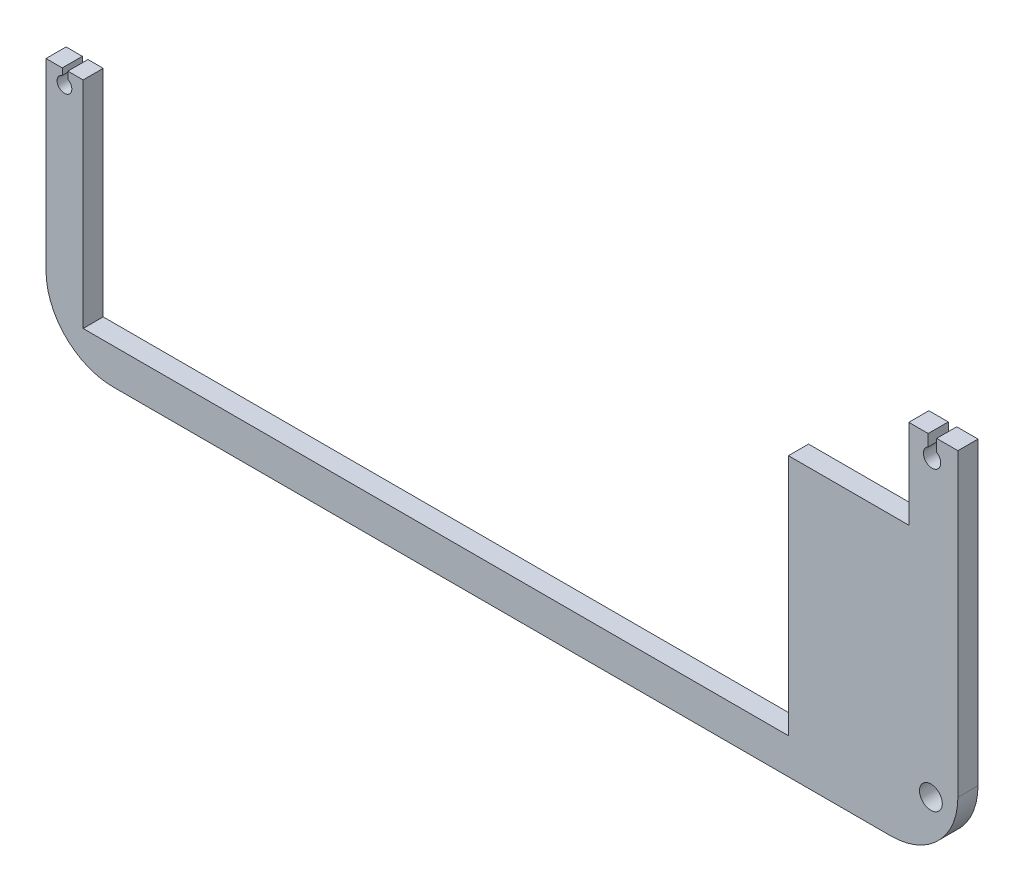
ISO-10303-21;
HEADER;
FILE_DESCRIPTION(('STEP AP214'),'2;1');
FILE_NAME('part.step','',(''),(''),'','','');
FILE_SCHEMA(('AUTOMOTIVE_DESIGN { 1 0 10303 214 1 1 1 1 }'));
ENDSEC;
DATA;
#1=APPLICATION_CONTEXT('core data for automotive mechanical design processes');
#2=APPLICATION_PROTOCOL_DEFINITION('international standard','automotive_design',2000,#1);
#3=PRODUCT_CONTEXT('',#1,'mechanical');
#4=PRODUCT('Part','Part','',(#3));
#5=PRODUCT_RELATED_PRODUCT_CATEGORY('part','',(#4));
#6=PRODUCT_DEFINITION_FORMATION('','',#4);
#7=PRODUCT_DEFINITION_CONTEXT('part definition',#1,'design');
#8=PRODUCT_DEFINITION('design','',#6,#7);
#9=PRODUCT_DEFINITION_SHAPE('','',#8);
#10=(LENGTH_UNIT() NAMED_UNIT(*) SI_UNIT(.MILLI.,.METRE.));
#11=(NAMED_UNIT(*) PLANE_ANGLE_UNIT() SI_UNIT($,.RADIAN.));
#12=(NAMED_UNIT(*) SI_UNIT($,.STERADIAN.) SOLID_ANGLE_UNIT());
#13=UNCERTAINTY_MEASURE_WITH_UNIT(LENGTH_MEASURE(1.E-05),#10,'distance_accuracy_value','');
#14=(GEOMETRIC_REPRESENTATION_CONTEXT(3) GLOBAL_UNCERTAINTY_ASSIGNED_CONTEXT((#13)) GLOBAL_UNIT_ASSIGNED_CONTEXT((#10,
#11,#12)) REPRESENTATION_CONTEXT('',''));
#15=CARTESIAN_POINT('',(0.,0.,0.));
#16=DIRECTION('',(0.,0.,1.));
#17=DIRECTION('',(1.,0.,0.));
#18=AXIS2_PLACEMENT_3D('',#15,#16,#17);
#19=CARTESIAN_POINT('',(-93.5366002876996,83.7988417423297,3.));
#20=DIRECTION('',(0.,0.,1.));
#21=DIRECTION('',(1.,0.,0.));
#22=AXIS2_PLACEMENT_3D('',#19,#20,#21);
#23=PLANE('',#22);
#24=DIRECTION('',(1.,0.,0.));
#25=VECTOR('',#24,1.);
#26=CARTESIAN_POINT('',(36.4199959893713,128.591552724159,3.));
#27=LINE('',#26,#25);
#28=CARTESIAN_POINT('',(29.3570180219026,128.591552724159,3.));
#29=VERTEX_POINT('',#28);
#30=CARTESIAN_POINT('',(32.5266585604708,128.591552724159,3.));
#31=VERTEX_POINT('',#30);
#32=EDGE_CURVE('E210',#29,#31,#27,.T.);
#33=ORIENTED_EDGE('',*,*,#32,.F.);
#34=DIRECTION('',(0.,1.,0.));
#35=VECTOR('',#34,1.);
#36=CARTESIAN_POINT('',(29.3570180219026,128.591552724159,3.));
#37=LINE('',#36,#35);
#38=CARTESIAN_POINT('',(29.3570180219026,126.795559320055,3.));
#39=VERTEX_POINT('',#38);
#40=EDGE_CURVE('E207',#39,#29,#37,.T.);
#41=ORIENTED_EDGE('',*,*,#40,.F.);
#42=CARTESIAN_POINT('',(28.6721951581703,125.696250987203,3.));
#43=DIRECTION('',(0.,0.,1.));
#44=DIRECTION('',(1.,0.,0.));
#45=AXIS2_PLACEMENT_3D('',#42,#43,#44);
#46=CIRCLE('',#45,1.29516839266913);
#47=CARTESIAN_POINT('',(28.0964021702591,126.856390461767,3.));
#48=VERTEX_POINT('',#47);
#49=EDGE_CURVE('E204',#48,#39,#46,.T.);
#50=ORIENTED_EDGE('',*,*,#49,.F.);
#51=DIRECTION('',(0.,-1.,0.));
#52=VECTOR('',#51,1.);
#53=CARTESIAN_POINT('',(28.0964021702591,126.856390461767,3.));
#54=LINE('',#53,#52);
#55=CARTESIAN_POINT('',(28.0964021702591,128.591552724159,3.));
#56=VERTEX_POINT('',#55);
#57=EDGE_CURVE('E201',#56,#48,#54,.T.);
#58=ORIENTED_EDGE('',*,*,#57,.F.);
#59=DIRECTION('',(1.,0.,0.));
#60=VECTOR('',#59,1.);
#61=CARTESIAN_POINT('',(28.0964021702591,128.591552724159,3.));
#62=LINE('',#61,#60);
#63=CARTESIAN_POINT('',(25.2004644446023,128.591552724159,3.));
#64=VERTEX_POINT('',#63);
#65=EDGE_CURVE('E196',#64,#56,#62,.T.);
#66=ORIENTED_EDGE('',*,*,#65,.F.);
#67=DIRECTION('',(0.,1.,0.));
#68=VECTOR('',#67,1.);
#69=CARTESIAN_POINT('',(25.2004644446023,115.29884174233,3.));
#70=LINE('',#69,#68);
#71=CARTESIAN_POINT('',(25.2004644446023,115.29884174233,3.));
#72=VERTEX_POINT('',#71);
#73=EDGE_CURVE('E254',#72,#64,#70,.T.);
#74=ORIENTED_EDGE('',*,*,#73,.F.);
#75=DIRECTION('',(1.,0.,0.));
#76=VECTOR('',#75,1.);
#77=CARTESIAN_POINT('',(7.24125127890715,115.29884174233,3.));
#78=LINE('',#77,#76);
#79=CARTESIAN_POINT('',(7.24125127890715,115.29884174233,3.));
#80=VERTEX_POINT('',#79);
#81=EDGE_CURVE('E252',#80,#72,#78,.T.);
#82=ORIENTED_EDGE('',*,*,#81,.F.);
#83=DIRECTION('',(0.,1.,0.));
#84=VECTOR('',#83,1.);
#85=CARTESIAN_POINT('',(7.24125127890715,79.1137548031266,3.));
#86=LINE('',#85,#84);
#87=CARTESIAN_POINT('',(7.24125127890715,79.1137548031266,3.));
#88=VERTEX_POINT('',#87);
#89=EDGE_CURVE('E249',#88,#80,#86,.T.);
#90=ORIENTED_EDGE('',*,*,#89,.F.);
#91=DIRECTION('',(1.,0.,0.));
#92=VECTOR('',#91,1.);
#93=CARTESIAN_POINT('',(-98.,79.1137548031266,3.));
#94=LINE('',#93,#92);
#95=CARTESIAN_POINT('',(-98.,79.1137548031266,3.));
#96=VERTEX_POINT('',#95);
#97=EDGE_CURVE('E247',#96,#88,#94,.T.);
#98=ORIENTED_EDGE('',*,*,#97,.F.);
#99=DIRECTION('',(0.,-1.,0.));
#100=VECTOR('',#99,1.);
#101=CARTESIAN_POINT('',(-98.,139.29884174233,3.));
#102=LINE('',#101,#100);
#103=CARTESIAN_POINT('',(-98.,111.232980273144,3.));
#104=VERTEX_POINT('',#103);
#105=EDGE_CURVE('E257',#104,#96,#102,.T.);
#106=ORIENTED_EDGE('',*,*,#105,.F.);
#107=DIRECTION('',(1.,0.,0.));
#108=VECTOR('',#107,1.);
#109=CARTESIAN_POINT('',(-98.,111.232980273144,3.));
#110=LINE('',#109,#108);
#111=CARTESIAN_POINT('',(-100.276015926956,111.232980273144,3.));
#112=VERTEX_POINT('',#111);
#113=EDGE_CURVE('E55',#112,#104,#110,.T.);
#114=ORIENTED_EDGE('',*,*,#113,.F.);
#115=DIRECTION('',(0.,1.,0.));
#116=VECTOR('',#115,1.);
#117=CARTESIAN_POINT('',(-100.276015926956,110.18127949506,3.));
#118=LINE('',#117,#116);
#119=CARTESIAN_POINT('',(-100.276015926956,110.18127949506,3.));
#120=VERTEX_POINT('',#119);
#121=EDGE_CURVE('E175',#120,#112,#118,.T.);
#122=ORIENTED_EDGE('',*,*,#121,.F.);
#123=CARTESIAN_POINT('',(-100.78551890269,109.206298272728,3.));
#124=DIRECTION('',(0.,0.,1.));
#125=DIRECTION('',(1.,0.,0.));
#126=AXIS2_PLACEMENT_3D('',#123,#124,#125);
#127=CIRCLE('',#126,1.10008257243818);
#128=CARTESIAN_POINT('',(-101.110575193587,110.257259772466,3.));
#129=VERTEX_POINT('',#128);
#130=EDGE_CURVE('E184',#129,#120,#127,.T.);
#131=ORIENTED_EDGE('',*,*,#130,.F.);
#132=DIRECTION('',(0.,-1.,0.));
#133=VECTOR('',#132,1.);
#134=CARTESIAN_POINT('',(-101.110575193587,110.257259772466,3.));
#135=LINE('',#134,#133);
#136=CARTESIAN_POINT('',(-101.110575193587,111.232980273144,3.));
#137=VERTEX_POINT('',#136);
#138=EDGE_CURVE('E181',#137,#129,#135,.T.);
#139=ORIENTED_EDGE('',*,*,#138,.F.);
#140=DIRECTION('',(1.,0.,0.));
#141=VECTOR('',#140,1.);
#142=CARTESIAN_POINT('',(-101.110575193587,111.232980273144,3.));
#143=LINE('',#142,#141);
#144=CARTESIAN_POINT('',(-103.5366002877,111.232980273144,3.));
#145=VERTEX_POINT('',#144);
#146=EDGE_CURVE('E212',#145,#137,#143,.T.);
#147=ORIENTED_EDGE('',*,*,#146,.F.);
#148=DIRECTION('',(0.,-1.,0.));
#149=VECTOR('',#148,1.);
#150=CARTESIAN_POINT('',(-103.5366002877,133.79884174233,3.));
#151=LINE('',#150,#149);
#152=CARTESIAN_POINT('',(-103.5366002877,83.7988417423297,3.));
#153=VERTEX_POINT('',#152);
#154=EDGE_CURVE('E293',#145,#153,#151,.T.);
#155=ORIENTED_EDGE('',*,*,#154,.T.);
#156=CARTESIAN_POINT('',(-93.5366002876996,83.7988417423297,3.));
#157=DIRECTION('',(0.,0.,1.));
#158=DIRECTION('',(1.,0.,0.));
#159=AXIS2_PLACEMENT_3D('',#156,#157,#158);
#160=CIRCLE('',#159,10.);
#161=CARTESIAN_POINT('',(-93.5366002876996,73.7988417423297,3.));
#162=VERTEX_POINT('',#161);
#163=EDGE_CURVE('E282',#153,#162,#160,.T.);
#164=ORIENTED_EDGE('',*,*,#163,.T.);
#165=DIRECTION('',(1.,0.,0.));
#166=VECTOR('',#165,1.);
#167=CARTESIAN_POINT('',(-93.5366002876996,73.7988417423297,3.));
#168=LINE('',#167,#166);
#169=CARTESIAN_POINT('',(22.5266585604708,73.7988417423297,3.));
#170=VERTEX_POINT('',#169);
#171=EDGE_CURVE('E285',#162,#170,#168,.T.);
#172=ORIENTED_EDGE('',*,*,#171,.T.);
#173=CARTESIAN_POINT('',(22.5266585604708,83.7988417423297,3.));
#174=DIRECTION('',(0.,0.,1.));
#175=DIRECTION('',(1.,0.,0.));
#176=AXIS2_PLACEMENT_3D('',#173,#174,#175);
#177=CIRCLE('',#176,10.);
#178=CARTESIAN_POINT('',(32.5266585604708,83.7988417423297,3.));
#179=VERTEX_POINT('',#178);
#180=EDGE_CURVE('E288',#170,#179,#177,.T.);
#181=ORIENTED_EDGE('',*,*,#180,.T.);
#182=DIRECTION('',(0.,1.,0.));
#183=VECTOR('',#182,1.);
#184=CARTESIAN_POINT('',(32.5266585604708,83.7988417423297,3.));
#185=LINE('',#184,#183);
#186=EDGE_CURVE('E290',#179,#31,#185,.T.);
#187=ORIENTED_EDGE('',*,*,#186,.T.);
#188=EDGE_LOOP('',(#33,#41,#50,#58,#66,#74,#82,#90,#98,#106,#114,#122,#131,#139,#147,#155,#164,
#172,#181,#187));
#189=FACE_BOUND('',#188,.T.);
#190=CARTESIAN_POINT('',(28.4975365255553,81.7988417423297,3.));
#191=DIRECTION('',(0.,0.,-1.));
#192=DIRECTION('',(-1.,0.,0.));
#193=AXIS2_PLACEMENT_3D('',#190,#191,#192);
#194=CIRCLE('',#193,1.7);
#195=CARTESIAN_POINT('',(26.7975365255553,81.7988417423297,3.));
#196=VERTEX_POINT('',#195);
#197=EDGE_CURVE('E243',#196,#196,#194,.T.);
#198=ORIENTED_EDGE('',*,*,#197,.T.);
#199=EDGE_LOOP('',(#198));
#200=FACE_BOUND('',#199,.T.);
#201=ADVANCED_FACE('F32',(#189,#200),#23,.T.);
#202=CARTESIAN_POINT('',(-93.5366002876996,83.7988417423297,0.));
#203=DIRECTION('',(0.,0.,1.));
#204=DIRECTION('',(1.,0.,0.));
#205=AXIS2_PLACEMENT_3D('',#202,#203,#204);
#206=PLANE('',#205);
#207=CARTESIAN_POINT('',(28.4975365255553,81.7988417423297,0.));
#208=DIRECTION('',(0.,0.,-1.));
#209=DIRECTION('',(-1.,0.,0.));
#210=AXIS2_PLACEMENT_3D('',#207,#208,#209);
#211=CIRCLE('',#210,1.69999999999999);
#212=CARTESIAN_POINT('',(26.7975365255553,81.7988417423297,0.));
#213=VERTEX_POINT('',#212);
#214=EDGE_CURVE('E240',#213,#213,#211,.T.);
#215=ORIENTED_EDGE('',*,*,#214,.F.);
#216=EDGE_LOOP('',(#215));
#217=FACE_BOUND('',#216,.T.);
#218=DIRECTION('',(0.,1.,0.));
#219=VECTOR('',#218,1.);
#220=CARTESIAN_POINT('',(29.3570180219026,83.7988417423297,0.));
#221=LINE('',#220,#219);
#222=CARTESIAN_POINT('',(29.3570180219026,126.795559320055,0.));
#223=VERTEX_POINT('',#222);
#224=CARTESIAN_POINT('',(29.3570180219026,128.591552724159,0.));
#225=VERTEX_POINT('',#224);
#226=EDGE_CURVE('E11',#223,#225,#221,.T.);
#227=ORIENTED_EDGE('',*,*,#226,.T.);
#228=DIRECTION('',(1.,0.,0.));
#229=VECTOR('',#228,1.);
#230=CARTESIAN_POINT('',(-93.5366002876996,128.591552724159,0.));
#231=LINE('',#230,#229);
#232=CARTESIAN_POINT('',(32.5266585604708,128.591552724159,0.));
#233=VERTEX_POINT('',#232);
#234=EDGE_CURVE('E237',#225,#233,#231,.T.);
#235=ORIENTED_EDGE('',*,*,#234,.T.);
#236=DIRECTION('',(0.,1.,0.));
#237=VECTOR('',#236,1.);
#238=CARTESIAN_POINT('',(32.5266585604708,83.7988417423297,0.));
#239=LINE('',#238,#237);
#240=CARTESIAN_POINT('',(32.5266585604708,83.7988417423297,0.));
#241=VERTEX_POINT('',#240);
#242=EDGE_CURVE('E302',#241,#233,#239,.T.);
#243=ORIENTED_EDGE('',*,*,#242,.F.);
#244=CARTESIAN_POINT('',(22.5266585604708,83.7988417423297,0.));
#245=DIRECTION('',(0.,0.,1.));
#246=DIRECTION('',(1.,0.,0.));
#247=AXIS2_PLACEMENT_3D('',#244,#245,#246);
#248=CIRCLE('',#247,10.);
#249=CARTESIAN_POINT('',(22.5266585604708,73.7988417423297,0.));
#250=VERTEX_POINT('',#249);
#251=EDGE_CURVE('E300',#250,#241,#248,.T.);
#252=ORIENTED_EDGE('',*,*,#251,.F.);
#253=DIRECTION('',(1.,0.,0.));
#254=VECTOR('',#253,1.);
#255=CARTESIAN_POINT('',(-93.5366002876996,73.7988417423297,0.));
#256=LINE('',#255,#254);
#257=CARTESIAN_POINT('',(-93.5366002876996,73.7988417423297,0.));
#258=VERTEX_POINT('',#257);
#259=EDGE_CURVE('E298',#258,#250,#256,.T.);
#260=ORIENTED_EDGE('',*,*,#259,.F.);
#261=CARTESIAN_POINT('',(-93.5366002876996,83.7988417423297,0.));
#262=DIRECTION('',(0.,0.,1.));
#263=DIRECTION('',(1.,0.,0.));
#264=AXIS2_PLACEMENT_3D('',#261,#262,#263);
#265=CIRCLE('',#264,10.);
#266=CARTESIAN_POINT('',(-103.5366002877,83.7988417423297,0.));
#267=VERTEX_POINT('',#266);
#268=EDGE_CURVE('E281',#267,#258,#265,.T.);
#269=ORIENTED_EDGE('',*,*,#268,.F.);
#270=DIRECTION('',(0.,-1.,0.));
#271=VECTOR('',#270,1.);
#272=CARTESIAN_POINT('',(-103.5366002877,133.79884174233,0.));
#273=LINE('',#272,#271);
#274=CARTESIAN_POINT('',(-103.5366002877,111.232980273144,0.));
#275=VERTEX_POINT('',#274);
#276=EDGE_CURVE('E286',#275,#267,#273,.T.);
#277=ORIENTED_EDGE('',*,*,#276,.F.);
#278=DIRECTION('',(1.,0.,0.));
#279=VECTOR('',#278,1.);
#280=CARTESIAN_POINT('',(-93.5366002876996,111.232980273144,0.));
#281=LINE('',#280,#279);
#282=CARTESIAN_POINT('',(-101.110575193587,111.232980273144,0.));
#283=VERTEX_POINT('',#282);
#284=EDGE_CURVE('E234',#275,#283,#281,.T.);
#285=ORIENTED_EDGE('',*,*,#284,.T.);
#286=DIRECTION('',(0.,-1.,0.));
#287=VECTOR('',#286,1.);
#288=CARTESIAN_POINT('',(-101.110575193587,83.7988417423297,0.));
#289=LINE('',#288,#287);
#290=CARTESIAN_POINT('',(-101.110575193587,110.257259772466,0.));
#291=VERTEX_POINT('',#290);
#292=EDGE_CURVE('E328',#283,#291,#289,.T.);
#293=ORIENTED_EDGE('',*,*,#292,.T.);
#294=CARTESIAN_POINT('',(-100.78551890269,109.206298272728,0.));
#295=DIRECTION('',(0.,0.,1.));
#296=DIRECTION('',(1.,0.,0.));
#297=AXIS2_PLACEMENT_3D('',#294,#295,#296);
#298=CIRCLE('',#297,1.10008257243818);
#299=CARTESIAN_POINT('',(-100.276015926956,110.18127949506,0.));
#300=VERTEX_POINT('',#299);
#301=EDGE_CURVE('E326',#291,#300,#298,.T.);
#302=ORIENTED_EDGE('',*,*,#301,.T.);
#303=DIRECTION('',(0.,1.,0.));
#304=VECTOR('',#303,1.);
#305=CARTESIAN_POINT('',(-100.276015926956,83.7988417423297,0.));
#306=LINE('',#305,#304);
#307=CARTESIAN_POINT('',(-100.276015926956,111.232980273144,0.));
#308=VERTEX_POINT('',#307);
#309=EDGE_CURVE('E177',#300,#308,#306,.T.);
#310=ORIENTED_EDGE('',*,*,#309,.T.);
#311=DIRECTION('',(1.,0.,0.));
#312=VECTOR('',#311,1.);
#313=CARTESIAN_POINT('',(-93.5366002876996,111.232980273144,0.));
#314=LINE('',#313,#312);
#315=CARTESIAN_POINT('',(-98.,111.232980273144,0.));
#316=VERTEX_POINT('',#315);
#317=EDGE_CURVE('E217',#308,#316,#314,.T.);
#318=ORIENTED_EDGE('',*,*,#317,.T.);
#319=DIRECTION('',(0.,-1.,0.));
#320=VECTOR('',#319,1.);
#321=CARTESIAN_POINT('',(-98.,139.29884174233,0.));
#322=LINE('',#321,#320);
#323=CARTESIAN_POINT('',(-98.,79.1137548031266,0.));
#324=VERTEX_POINT('',#323);
#325=EDGE_CURVE('E250',#316,#324,#322,.T.);
#326=ORIENTED_EDGE('',*,*,#325,.T.);
#327=DIRECTION('',(1.,0.,0.));
#328=VECTOR('',#327,1.);
#329=CARTESIAN_POINT('',(-98.,79.1137548031266,0.));
#330=LINE('',#329,#328);
#331=CARTESIAN_POINT('',(7.24125127890715,79.1137548031266,0.));
#332=VERTEX_POINT('',#331);
#333=EDGE_CURVE('E246',#324,#332,#330,.T.);
#334=ORIENTED_EDGE('',*,*,#333,.T.);
#335=DIRECTION('',(0.,1.,0.));
#336=VECTOR('',#335,1.);
#337=CARTESIAN_POINT('',(7.24125127890715,79.1137548031266,0.));
#338=LINE('',#337,#336);
#339=CARTESIAN_POINT('',(7.24125127890715,115.29884174233,0.));
#340=VERTEX_POINT('',#339);
#341=EDGE_CURVE('E262',#332,#340,#338,.T.);
#342=ORIENTED_EDGE('',*,*,#341,.T.);
#343=DIRECTION('',(1.,0.,0.));
#344=VECTOR('',#343,1.);
#345=CARTESIAN_POINT('',(7.24125127890715,115.29884174233,0.));
#346=LINE('',#345,#344);
#347=CARTESIAN_POINT('',(25.2004644446023,115.29884174233,0.));
#348=VERTEX_POINT('',#347);
#349=EDGE_CURVE('E265',#340,#348,#346,.T.);
#350=ORIENTED_EDGE('',*,*,#349,.T.);
#351=DIRECTION('',(0.,1.,0.));
#352=VECTOR('',#351,1.);
#353=CARTESIAN_POINT('',(25.2004644446023,115.29884174233,0.));
#354=LINE('',#353,#352);
#355=CARTESIAN_POINT('',(25.2004644446023,128.591552724159,0.));
#356=VERTEX_POINT('',#355);
#357=EDGE_CURVE('E268',#348,#356,#354,.T.);
#358=ORIENTED_EDGE('',*,*,#357,.T.);
#359=DIRECTION('',(1.,0.,0.));
#360=VECTOR('',#359,1.);
#361=CARTESIAN_POINT('',(-93.5366002876996,128.591552724159,0.));
#362=LINE('',#361,#360);
#363=CARTESIAN_POINT('',(28.0964021702591,128.591552724159,0.));
#364=VERTEX_POINT('',#363);
#365=EDGE_CURVE('E47',#356,#364,#362,.T.);
#366=ORIENTED_EDGE('',*,*,#365,.T.);
#367=DIRECTION('',(0.,-1.,0.));
#368=VECTOR('',#367,1.);
#369=CARTESIAN_POINT('',(28.0964021702591,83.7988417423297,0.));
#370=LINE('',#369,#368);
#371=CARTESIAN_POINT('',(28.0964021702591,126.856390461767,0.));
#372=VERTEX_POINT('',#371);
#373=EDGE_CURVE('E331',#364,#372,#370,.T.);
#374=ORIENTED_EDGE('',*,*,#373,.T.);
#375=CARTESIAN_POINT('',(28.6721951581703,125.696250987203,0.));
#376=DIRECTION('',(0.,0.,1.));
#377=DIRECTION('',(1.,0.,0.));
#378=AXIS2_PLACEMENT_3D('',#375,#376,#377);
#379=CIRCLE('',#378,1.29516839266913);
#380=EDGE_CURVE('E40',#372,#223,#379,.T.);
#381=ORIENTED_EDGE('',*,*,#380,.T.);
#382=EDGE_LOOP('',(#227,#235,#243,#252,#260,#269,#277,#285,#293,#302,#310,#318,#326,#334,#342,
#350,#358,#366,#374,#381));
#383=FACE_BOUND('',#382,.T.);
#384=ADVANCED_FACE('F335',(#217,#383),#206,.F.);
#385=CARTESIAN_POINT('',(-93.5366002876996,83.7988417423297,3.));
#386=DIRECTION('',(0.,0.,-1.));
#387=DIRECTION('',(-1.,0.,0.));
#388=AXIS2_PLACEMENT_3D('',#385,#386,#387);
#389=CYLINDRICAL_SURFACE('',#388,10.);
#390=ORIENTED_EDGE('',*,*,#268,.T.);
#391=DIRECTION('',(0.,0.,-1.));
#392=VECTOR('',#391,1.);
#393=CARTESIAN_POINT('',(-93.5366002876996,73.7988417423297,3.));
#394=LINE('',#393,#392);
#395=EDGE_CURVE('E314',#162,#258,#394,.T.);
#396=ORIENTED_EDGE('',*,*,#395,.F.);
#397=ORIENTED_EDGE('',*,*,#163,.F.);
#398=DIRECTION('',(0.,0.,-1.));
#399=VECTOR('',#398,1.);
#400=CARTESIAN_POINT('',(-103.5366002877,83.7988417423297,3.));
#401=LINE('',#400,#399);
#402=EDGE_CURVE('E295',#153,#267,#401,.T.);
#403=ORIENTED_EDGE('',*,*,#402,.T.);
#404=EDGE_LOOP('',(#390,#396,#397,#403));
#405=FACE_BOUND('',#404,.T.);
#406=ADVANCED_FACE('F34',(#405),#389,.T.);
#407=CARTESIAN_POINT('',(-93.5366002876996,73.7988417423297,3.));
#408=DIRECTION('',(0.,1.,0.));
#409=DIRECTION('',(0.,0.,1.));
#410=AXIS2_PLACEMENT_3D('',#407,#408,#409);
#411=PLANE('',#410);
#412=ORIENTED_EDGE('',*,*,#259,.T.);
#413=DIRECTION('',(0.,0.,-1.));
#414=VECTOR('',#413,1.);
#415=CARTESIAN_POINT('',(22.5266585604708,73.7988417423297,3.));
#416=LINE('',#415,#414);
#417=EDGE_CURVE('E311',#170,#250,#416,.T.);
#418=ORIENTED_EDGE('',*,*,#417,.F.);
#419=ORIENTED_EDGE('',*,*,#171,.F.);
#420=ORIENTED_EDGE('',*,*,#395,.T.);
#421=EDGE_LOOP('',(#412,#418,#419,#420));
#422=FACE_BOUND('',#421,.T.);
#423=ADVANCED_FACE('F365',(#422),#411,.F.);
#424=CARTESIAN_POINT('',(22.5266585604708,83.7988417423297,3.));
#425=DIRECTION('',(0.,0.,-1.));
#426=DIRECTION('',(-1.,0.,0.));
#427=AXIS2_PLACEMENT_3D('',#424,#425,#426);
#428=CYLINDRICAL_SURFACE('',#427,10.);
#429=ORIENTED_EDGE('',*,*,#251,.T.);
#430=DIRECTION('',(0.,0.,-1.));
#431=VECTOR('',#430,1.);
#432=CARTESIAN_POINT('',(32.5266585604708,83.7988417423297,3.));
#433=LINE('',#432,#431);
#434=EDGE_CURVE('E308',#179,#241,#433,.T.);
#435=ORIENTED_EDGE('',*,*,#434,.F.);
#436=ORIENTED_EDGE('',*,*,#180,.F.);
#437=ORIENTED_EDGE('',*,*,#417,.T.);
#438=EDGE_LOOP('',(#429,#435,#436,#437));
#439=FACE_BOUND('',#438,.T.);
#440=ADVANCED_FACE('F359',(#439),#428,.T.);
#441=CARTESIAN_POINT('',(32.5266585604708,83.7988417423297,3.));
#442=DIRECTION('',(-1.,0.,0.));
#443=DIRECTION('',(0.,0.,1.));
#444=AXIS2_PLACEMENT_3D('',#441,#442,#443);
#445=PLANE('',#444);
#446=ORIENTED_EDGE('',*,*,#242,.T.);
#447=DIRECTION('',(0.,0.,1.));
#448=VECTOR('',#447,1.);
#449=CARTESIAN_POINT('',(32.5266585604708,128.591552724159,3.));
#450=LINE('',#449,#448);
#451=EDGE_CURVE('E322',#233,#31,#450,.T.);
#452=ORIENTED_EDGE('',*,*,#451,.T.);
#453=ORIENTED_EDGE('',*,*,#186,.F.);
#454=ORIENTED_EDGE('',*,*,#434,.T.);
#455=EDGE_LOOP('',(#446,#452,#453,#454));
#456=FACE_BOUND('',#455,.T.);
#457=ADVANCED_FACE('F354',(#456),#445,.F.);
#458=CARTESIAN_POINT('',(-103.5366002877,133.79884174233,3.));
#459=DIRECTION('',(1.,0.,0.));
#460=DIRECTION('',(0.,0.,-1.));
#461=AXIS2_PLACEMENT_3D('',#458,#459,#460);
#462=PLANE('',#461);
#463=ORIENTED_EDGE('',*,*,#154,.F.);
#464=DIRECTION('',(0.,0.,-1.));
#465=VECTOR('',#464,1.);
#466=CARTESIAN_POINT('',(-103.5366002877,111.232980273144,3.));
#467=LINE('',#466,#465);
#468=EDGE_CURVE('E319',#145,#275,#467,.T.);
#469=ORIENTED_EDGE('',*,*,#468,.T.);
#470=ORIENTED_EDGE('',*,*,#276,.T.);
#471=ORIENTED_EDGE('',*,*,#402,.F.);
#472=EDGE_LOOP('',(#463,#469,#470,#471));
#473=FACE_BOUND('',#472,.T.);
#474=ADVANCED_FACE('F371',(#473),#462,.F.);
#475=CARTESIAN_POINT('',(-98.,79.1137548031266,3.));
#476=DIRECTION('',(0.,1.,0.));
#477=DIRECTION('',(0.,0.,1.));
#478=AXIS2_PLACEMENT_3D('',#475,#476,#477);
#479=PLANE('',#478);
#480=ORIENTED_EDGE('',*,*,#333,.F.);
#481=DIRECTION('',(0.,0.,-1.));
#482=VECTOR('',#481,1.);
#483=CARTESIAN_POINT('',(-98.,79.1137548031266,3.));
#484=LINE('',#483,#482);
#485=EDGE_CURVE('E259',#96,#324,#484,.T.);
#486=ORIENTED_EDGE('',*,*,#485,.F.);
#487=ORIENTED_EDGE('',*,*,#97,.T.);
#488=DIRECTION('',(0.,0.,-1.));
#489=VECTOR('',#488,1.);
#490=CARTESIAN_POINT('',(7.24125127890715,79.1137548031266,3.));
#491=LINE('',#490,#489);
#492=EDGE_CURVE('E278',#88,#332,#491,.T.);
#493=ORIENTED_EDGE('',*,*,#492,.T.);
#494=EDGE_LOOP('',(#480,#486,#487,#493));
#495=FACE_BOUND('',#494,.T.);
#496=ADVANCED_FACE('F394',(#495),#479,.T.);
#497=CARTESIAN_POINT('',(7.24125127890715,79.1137548031266,3.));
#498=DIRECTION('',(-1.,0.,0.));
#499=DIRECTION('',(0.,0.,1.));
#500=AXIS2_PLACEMENT_3D('',#497,#498,#499);
#501=PLANE('',#500);
#502=ORIENTED_EDGE('',*,*,#341,.F.);
#503=ORIENTED_EDGE('',*,*,#492,.F.);
#504=ORIENTED_EDGE('',*,*,#89,.T.);
#505=DIRECTION('',(0.,0.,-1.));
#506=VECTOR('',#505,1.);
#507=CARTESIAN_POINT('',(7.24125127890715,115.29884174233,3.));
#508=LINE('',#507,#506);
#509=EDGE_CURVE('E276',#80,#340,#508,.T.);
#510=ORIENTED_EDGE('',*,*,#509,.T.);
#511=EDGE_LOOP('',(#502,#503,#504,#510));
#512=FACE_BOUND('',#511,.T.);
#513=ADVANCED_FACE('F538',(#512),#501,.T.);
#514=CARTESIAN_POINT('',(7.24125127890715,115.29884174233,3.));
#515=DIRECTION('',(0.,1.,0.));
#516=DIRECTION('',(0.,0.,1.));
#517=AXIS2_PLACEMENT_3D('',#514,#515,#516);
#518=PLANE('',#517);
#519=ORIENTED_EDGE('',*,*,#349,.F.);
#520=ORIENTED_EDGE('',*,*,#509,.F.);
#521=ORIENTED_EDGE('',*,*,#81,.T.);
#522=DIRECTION('',(0.,0.,-1.));
#523=VECTOR('',#522,1.);
#524=CARTESIAN_POINT('',(25.2004644446023,115.29884174233,3.));
#525=LINE('',#524,#523);
#526=EDGE_CURVE('E274',#72,#348,#525,.T.);
#527=ORIENTED_EDGE('',*,*,#526,.T.);
#528=EDGE_LOOP('',(#519,#520,#521,#527));
#529=FACE_BOUND('',#528,.T.);
#530=ADVANCED_FACE('F441',(#529),#518,.T.);
#531=CARTESIAN_POINT('',(25.2004644446023,115.29884174233,3.));
#532=DIRECTION('',(-1.,0.,0.));
#533=DIRECTION('',(0.,0.,1.));
#534=AXIS2_PLACEMENT_3D('',#531,#532,#533);
#535=PLANE('',#534);
#536=DIRECTION('',(0.,0.,1.));
#537=VECTOR('',#536,1.);
#538=CARTESIAN_POINT('',(25.2004644446023,128.591552724159,-7.));
#539=LINE('',#538,#537);
#540=EDGE_CURVE('E228',#356,#64,#539,.T.);
#541=ORIENTED_EDGE('',*,*,#540,.F.);
#542=ORIENTED_EDGE('',*,*,#357,.F.);
#543=ORIENTED_EDGE('',*,*,#526,.F.);
#544=ORIENTED_EDGE('',*,*,#73,.T.);
#545=EDGE_LOOP('',(#541,#542,#543,#544));
#546=FACE_BOUND('',#545,.T.);
#547=ADVANCED_FACE('F435',(#546),#535,.T.);
#548=CARTESIAN_POINT('',(-98.,139.29884174233,3.));
#549=DIRECTION('',(1.,0.,0.));
#550=DIRECTION('',(0.,0.,-1.));
#551=AXIS2_PLACEMENT_3D('',#548,#549,#550);
#552=PLANE('',#551);
#553=DIRECTION('',(0.,0.,-1.));
#554=VECTOR('',#553,1.);
#555=CARTESIAN_POINT('',(-98.,111.232980273144,3.));
#556=LINE('',#555,#554);
#557=EDGE_CURVE('E317',#104,#316,#556,.T.);
#558=ORIENTED_EDGE('',*,*,#557,.F.);
#559=ORIENTED_EDGE('',*,*,#105,.T.);
#560=ORIENTED_EDGE('',*,*,#485,.T.);
#561=ORIENTED_EDGE('',*,*,#325,.F.);
#562=EDGE_LOOP('',(#558,#559,#560,#561));
#563=FACE_BOUND('',#562,.T.);
#564=ADVANCED_FACE('F440',(#563),#552,.T.);
#565=CARTESIAN_POINT('',(28.4975365255553,81.7988417423297,0.));
#566=DIRECTION('',(0.,0.,-1.));
#567=DIRECTION('',(-1.,0.,0.));
#568=AXIS2_PLACEMENT_3D('',#565,#566,#567);
#569=CYLINDRICAL_SURFACE('',#568,1.69999999999999);
#570=ORIENTED_EDGE('',*,*,#197,.F.);
#571=EDGE_LOOP('',(#570));
#572=FACE_BOUND('',#571,.T.);
#573=ORIENTED_EDGE('',*,*,#214,.T.);
#574=EDGE_LOOP('',(#573));
#575=FACE_BOUND('',#574,.T.);
#576=ADVANCED_FACE('F453',(#572,#575),#569,.F.);
#577=CARTESIAN_POINT('',(-98.,111.232980273144,-7.));
#578=DIRECTION('',(0.,-1.,0.));
#579=DIRECTION('',(0.,0.,-1.));
#580=AXIS2_PLACEMENT_3D('',#577,#578,#579);
#581=PLANE('',#580);
#582=DIRECTION('',(0.,0.,1.));
#583=VECTOR('',#582,1.);
#584=CARTESIAN_POINT('',(-100.276015926956,111.232980273144,-7.));
#585=LINE('',#584,#583);
#586=EDGE_CURVE('E180',#308,#112,#585,.T.);
#587=ORIENTED_EDGE('',*,*,#586,.T.);
#588=ORIENTED_EDGE('',*,*,#113,.T.);
#589=ORIENTED_EDGE('',*,*,#557,.T.);
#590=ORIENTED_EDGE('',*,*,#317,.F.);
#591=EDGE_LOOP('',(#587,#588,#589,#590));
#592=FACE_BOUND('',#591,.T.);
#593=ADVANCED_FACE('F461',(#592),#581,.F.);
#594=CARTESIAN_POINT('',(-100.276015926956,110.18127949506,-7.));
#595=DIRECTION('',(1.,0.,0.));
#596=DIRECTION('',(0.,0.,-1.));
#597=AXIS2_PLACEMENT_3D('',#594,#595,#596);
#598=PLANE('',#597);
#599=DIRECTION('',(0.,0.,1.));
#600=VECTOR('',#599,1.);
#601=CARTESIAN_POINT('',(-100.276015926956,110.18127949506,-7.));
#602=LINE('',#601,#600);
#603=EDGE_CURVE('E170',#300,#120,#602,.T.);
#604=ORIENTED_EDGE('',*,*,#603,.T.);
#605=ORIENTED_EDGE('',*,*,#121,.T.);
#606=ORIENTED_EDGE('',*,*,#586,.F.);
#607=ORIENTED_EDGE('',*,*,#309,.F.);
#608=EDGE_LOOP('',(#604,#605,#606,#607));
#609=FACE_BOUND('',#608,.T.);
#610=ADVANCED_FACE('F172',(#609),#598,.F.);
#611=CARTESIAN_POINT('',(-101.110575193587,111.232980273144,-7.));
#612=DIRECTION('',(0.,-1.,0.));
#613=DIRECTION('',(0.,0.,-1.));
#614=AXIS2_PLACEMENT_3D('',#611,#612,#613);
#615=PLANE('',#614);
#616=ORIENTED_EDGE('',*,*,#468,.F.);
#617=ORIENTED_EDGE('',*,*,#146,.T.);
#618=DIRECTION('',(0.,0.,1.));
#619=VECTOR('',#618,1.);
#620=CARTESIAN_POINT('',(-101.110575193587,111.232980273144,-7.));
#621=LINE('',#620,#619);
#622=EDGE_CURVE('E218',#283,#137,#621,.T.);
#623=ORIENTED_EDGE('',*,*,#622,.F.);
#624=ORIENTED_EDGE('',*,*,#284,.F.);
#625=EDGE_LOOP('',(#616,#617,#623,#624));
#626=FACE_BOUND('',#625,.T.);
#627=ADVANCED_FACE('F374',(#626),#615,.F.);
#628=CARTESIAN_POINT('',(-101.110575193587,110.257259772466,-7.));
#629=DIRECTION('',(-1.,0.,0.));
#630=DIRECTION('',(0.,0.,1.));
#631=AXIS2_PLACEMENT_3D('',#628,#629,#630);
#632=PLANE('',#631);
#633=ORIENTED_EDGE('',*,*,#622,.T.);
#634=ORIENTED_EDGE('',*,*,#138,.T.);
#635=DIRECTION('',(0.,0.,1.));
#636=VECTOR('',#635,1.);
#637=CARTESIAN_POINT('',(-101.110575193587,110.257259772466,-7.));
#638=LINE('',#637,#636);
#639=EDGE_CURVE('E187',#291,#129,#638,.T.);
#640=ORIENTED_EDGE('',*,*,#639,.F.);
#641=ORIENTED_EDGE('',*,*,#292,.F.);
#642=EDGE_LOOP('',(#633,#634,#640,#641));
#643=FACE_BOUND('',#642,.T.);
#644=ADVANCED_FACE('F377',(#643),#632,.F.);
#645=CARTESIAN_POINT('',(-100.78551890269,109.206298272728,-7.));
#646=DIRECTION('',(0.,0.,1.));
#647=DIRECTION('',(1.,0.,0.));
#648=AXIS2_PLACEMENT_3D('',#645,#646,#647);
#649=CYLINDRICAL_SURFACE('',#648,1.10008257243818);
#650=ORIENTED_EDGE('',*,*,#639,.T.);
#651=ORIENTED_EDGE('',*,*,#130,.T.);
#652=ORIENTED_EDGE('',*,*,#603,.F.);
#653=ORIENTED_EDGE('',*,*,#301,.F.);
#654=EDGE_LOOP('',(#650,#651,#652,#653));
#655=FACE_BOUND('',#654,.T.);
#656=ADVANCED_FACE('F185',(#655),#649,.F.);
#657=CARTESIAN_POINT('',(29.3570180219026,128.591552724159,-7.));
#658=DIRECTION('',(1.,0.,0.));
#659=DIRECTION('',(0.,0.,-1.));
#660=AXIS2_PLACEMENT_3D('',#657,#658,#659);
#661=PLANE('',#660);
#662=DIRECTION('',(0.,0.,1.));
#663=VECTOR('',#662,1.);
#664=CARTESIAN_POINT('',(29.3570180219026,126.795559320055,-7.));
#665=LINE('',#664,#663);
#666=EDGE_CURVE('E222',#223,#39,#665,.T.);
#667=ORIENTED_EDGE('',*,*,#666,.T.);
#668=ORIENTED_EDGE('',*,*,#40,.T.);
#669=DIRECTION('',(0.,0.,1.));
#670=VECTOR('',#669,1.);
#671=CARTESIAN_POINT('',(29.3570180219026,128.591552724159,-7.));
#672=LINE('',#671,#670);
#673=EDGE_CURVE('E220',#225,#29,#672,.T.);
#674=ORIENTED_EDGE('',*,*,#673,.F.);
#675=ORIENTED_EDGE('',*,*,#226,.F.);
#676=EDGE_LOOP('',(#667,#668,#674,#675));
#677=FACE_BOUND('',#676,.T.);
#678=ADVANCED_FACE('F348',(#677),#661,.F.);
#679=CARTESIAN_POINT('',(28.6721951581703,125.696250987203,-7.));
#680=DIRECTION('',(0.,0.,1.));
#681=DIRECTION('',(1.,0.,0.));
#682=AXIS2_PLACEMENT_3D('',#679,#680,#681);
#683=CYLINDRICAL_SURFACE('',#682,1.29516839266913);
#684=DIRECTION('',(0.,0.,1.));
#685=VECTOR('',#684,1.);
#686=CARTESIAN_POINT('',(28.0964021702591,126.856390461767,-7.));
#687=LINE('',#686,#685);
#688=EDGE_CURVE('E224',#372,#48,#687,.T.);
#689=ORIENTED_EDGE('',*,*,#688,.T.);
#690=ORIENTED_EDGE('',*,*,#49,.T.);
#691=ORIENTED_EDGE('',*,*,#666,.F.);
#692=ORIENTED_EDGE('',*,*,#380,.F.);
#693=EDGE_LOOP('',(#689,#690,#691,#692));
#694=FACE_BOUND('',#693,.T.);
#695=ADVANCED_FACE('F339',(#694),#683,.F.);
#696=CARTESIAN_POINT('',(28.0964021702591,126.856390461767,-7.));
#697=DIRECTION('',(-1.,0.,0.));
#698=DIRECTION('',(0.,0.,1.));
#699=AXIS2_PLACEMENT_3D('',#696,#697,#698);
#700=PLANE('',#699);
#701=DIRECTION('',(0.,0.,1.));
#702=VECTOR('',#701,1.);
#703=CARTESIAN_POINT('',(28.0964021702591,128.591552724159,-7.));
#704=LINE('',#703,#702);
#705=EDGE_CURVE('E226',#364,#56,#704,.T.);
#706=ORIENTED_EDGE('',*,*,#705,.T.);
#707=ORIENTED_EDGE('',*,*,#57,.T.);
#708=ORIENTED_EDGE('',*,*,#688,.F.);
#709=ORIENTED_EDGE('',*,*,#373,.F.);
#710=EDGE_LOOP('',(#706,#707,#708,#709));
#711=FACE_BOUND('',#710,.T.);
#712=ADVANCED_FACE('F341',(#711),#700,.F.);
#713=CARTESIAN_POINT('',(36.4199959893713,128.591552724159,-7.));
#714=DIRECTION('',(0.,-1.,0.));
#715=DIRECTION('',(0.,0.,-1.));
#716=AXIS2_PLACEMENT_3D('',#713,#714,#715);
#717=PLANE('',#716);
#718=ORIENTED_EDGE('',*,*,#673,.T.);
#719=ORIENTED_EDGE('',*,*,#32,.T.);
#720=ORIENTED_EDGE('',*,*,#451,.F.);
#721=ORIENTED_EDGE('',*,*,#234,.F.);
#722=EDGE_LOOP('',(#718,#719,#720,#721));
#723=FACE_BOUND('',#722,.T.);
#724=ADVANCED_FACE('F350',(#723),#717,.F.);
#725=CARTESIAN_POINT('',(28.0964021702591,128.591552724159,-7.));
#726=DIRECTION('',(0.,-1.,0.));
#727=DIRECTION('',(0.,0.,-1.));
#728=AXIS2_PLACEMENT_3D('',#725,#726,#727);
#729=PLANE('',#728);
#730=ORIENTED_EDGE('',*,*,#540,.T.);
#731=ORIENTED_EDGE('',*,*,#65,.T.);
#732=ORIENTED_EDGE('',*,*,#705,.F.);
#733=ORIENTED_EDGE('',*,*,#365,.F.);
#734=EDGE_LOOP('',(#730,#731,#732,#733));
#735=FACE_BOUND('',#734,.T.);
#736=ADVANCED_FACE('F523',(#735),#729,.F.);
#737=CLOSED_SHELL('',(#201,#384,#406,#423,#440,#457,#474,#496,#513,#530,#547,#564,#576,#593,
#610,#627,#644,#656,#678,#695,#712,#724,#736));
#738=MANIFOLD_SOLID_BREP('B2',#737);
#739=ADVANCED_BREP_SHAPE_REPRESENTATION('',(#18,#738),#14);
#740=SHAPE_DEFINITION_REPRESENTATION(#9,#739);
ENDSEC;
END-ISO-10303-21;
